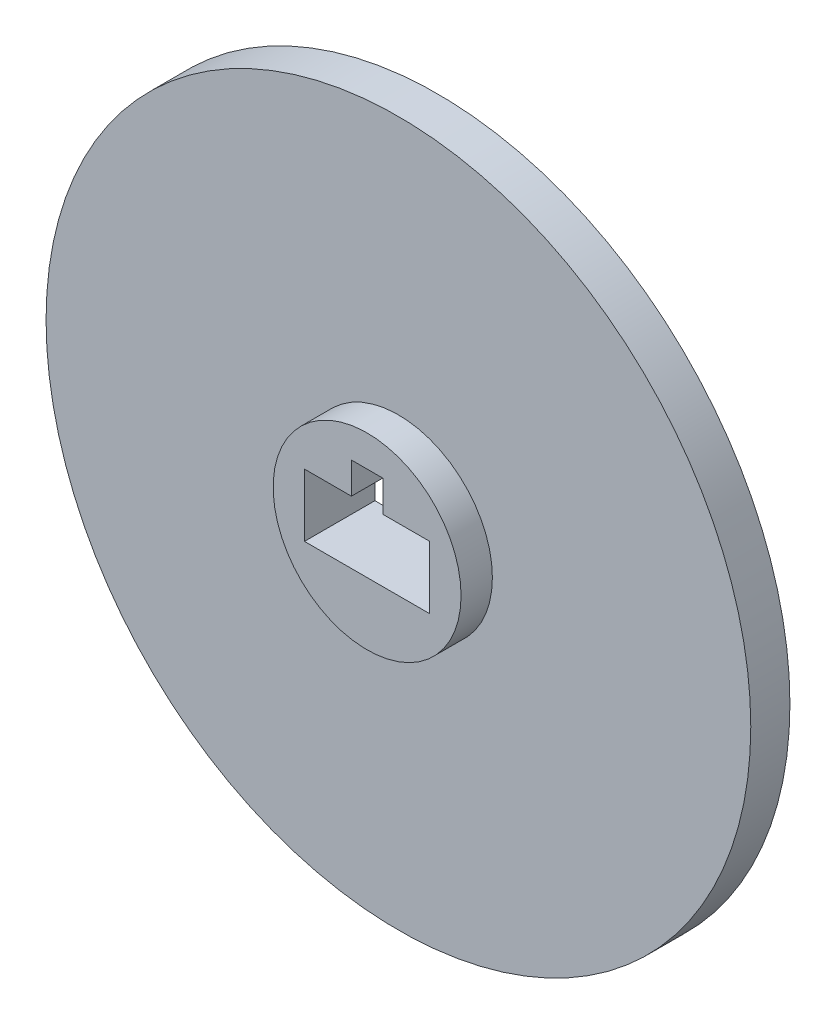
ISO-10303-21;
HEADER;
FILE_DESCRIPTION(('STEP AP214'),'2;1');
FILE_NAME('part.step','',(''),(''),'','','');
FILE_SCHEMA(('AUTOMOTIVE_DESIGN { 1 0 10303 214 1 1 1 1 }'));
ENDSEC;
DATA;
#1=APPLICATION_CONTEXT('core data for automotive mechanical design processes');
#2=APPLICATION_PROTOCOL_DEFINITION('international standard','automotive_design',2000,#1);
#3=PRODUCT_CONTEXT('',#1,'mechanical');
#4=PRODUCT('Part','Part','',(#3));
#5=PRODUCT_RELATED_PRODUCT_CATEGORY('part','',(#4));
#6=PRODUCT_DEFINITION_FORMATION('','',#4);
#7=PRODUCT_DEFINITION_CONTEXT('part definition',#1,'design');
#8=PRODUCT_DEFINITION('design','',#6,#7);
#9=PRODUCT_DEFINITION_SHAPE('','',#8);
#10=(LENGTH_UNIT() NAMED_UNIT(*) SI_UNIT(.MILLI.,.METRE.));
#11=(NAMED_UNIT(*) PLANE_ANGLE_UNIT() SI_UNIT($,.RADIAN.));
#12=(NAMED_UNIT(*) SI_UNIT($,.STERADIAN.) SOLID_ANGLE_UNIT());
#13=UNCERTAINTY_MEASURE_WITH_UNIT(LENGTH_MEASURE(1.E-05),#10,'distance_accuracy_value','');
#14=(GEOMETRIC_REPRESENTATION_CONTEXT(3) GLOBAL_UNCERTAINTY_ASSIGNED_CONTEXT((#13)) GLOBAL_UNIT_ASSIGNED_CONTEXT((#10,
#11,#12)) REPRESENTATION_CONTEXT('',''));
#15=CARTESIAN_POINT('',(0.,0.,0.));
#16=DIRECTION('',(0.,0.,1.));
#17=DIRECTION('',(1.,0.,0.));
#18=AXIS2_PLACEMENT_3D('',#15,#16,#17);
#19=CARTESIAN_POINT('',(0.,0.,2.5));
#20=DIRECTION('',(0.,0.,-1.));
#21=DIRECTION('',(-1.,0.,0.));
#22=AXIS2_PLACEMENT_3D('',#19,#20,#21);
#23=CYLINDRICAL_SURFACE('',#22,22.5);
#24=CARTESIAN_POINT('',(0.,0.,2.5));
#25=DIRECTION('',(0.,0.,1.));
#26=DIRECTION('',(1.,0.,0.));
#27=AXIS2_PLACEMENT_3D('',#24,#25,#26);
#28=CIRCLE('',#27,22.5);
#29=CARTESIAN_POINT('',(22.5,0.,2.5));
#30=VERTEX_POINT('',#29);
#31=EDGE_CURVE('E41',#30,#30,#28,.T.);
#32=ORIENTED_EDGE('',*,*,#31,.F.);
#33=EDGE_LOOP('',(#32));
#34=FACE_BOUND('',#33,.T.);
#35=CARTESIAN_POINT('',(0.,0.,0.));
#36=DIRECTION('',(0.,0.,1.));
#37=DIRECTION('',(1.,0.,0.));
#38=AXIS2_PLACEMENT_3D('',#35,#36,#37);
#39=CIRCLE('',#38,22.5);
#40=CARTESIAN_POINT('',(22.5,0.,0.));
#41=VERTEX_POINT('',#40);
#42=EDGE_CURVE('E36',#41,#41,#39,.T.);
#43=ORIENTED_EDGE('',*,*,#42,.T.);
#44=EDGE_LOOP('',(#43));
#45=FACE_BOUND('',#44,.T.);
#46=ADVANCED_FACE('F33',(#34,#45),#23,.T.);
#47=CARTESIAN_POINT('',(0.,0.,2.5));
#48=DIRECTION('',(0.,0.,1.));
#49=DIRECTION('',(1.,0.,0.));
#50=AXIS2_PLACEMENT_3D('',#47,#48,#49);
#51=PLANE('',#50);
#52=CARTESIAN_POINT('',(0.,0.,2.5));
#53=DIRECTION('',(0.,0.,1.));
#54=DIRECTION('',(1.,0.,0.));
#55=AXIS2_PLACEMENT_3D('',#52,#53,#54);
#56=CIRCLE('',#55,6.);
#57=CARTESIAN_POINT('',(6.,0.,2.5));
#58=VERTEX_POINT('',#57);
#59=EDGE_CURVE('E11',#58,#58,#56,.T.);
#60=ORIENTED_EDGE('',*,*,#59,.F.);
#61=EDGE_LOOP('',(#60));
#62=FACE_BOUND('',#61,.T.);
#63=ORIENTED_EDGE('',*,*,#31,.T.);
#64=EDGE_LOOP('',(#63));
#65=FACE_BOUND('',#64,.T.);
#66=ADVANCED_FACE('F181',(#62,#65),#51,.T.);
#67=CARTESIAN_POINT('',(0.,0.,0.));
#68=DIRECTION('',(0.,0.,1.));
#69=DIRECTION('',(1.,0.,0.));
#70=AXIS2_PLACEMENT_3D('',#67,#68,#69);
#71=PLANE('',#70);
#72=DIRECTION('',(1.,0.,0.));
#73=VECTOR('',#72,1.);
#74=CARTESIAN_POINT('',(0.,-2.,0.));
#75=LINE('',#74,#73);
#76=CARTESIAN_POINT('',(-4.,-2.,0.));
#77=VERTEX_POINT('',#76);
#78=CARTESIAN_POINT('',(4.,-2.,0.));
#79=VERTEX_POINT('',#78);
#80=EDGE_CURVE('E163',#77,#79,#75,.T.);
#81=ORIENTED_EDGE('',*,*,#80,.T.);
#82=DIRECTION('',(0.,1.,0.));
#83=VECTOR('',#82,1.);
#84=CARTESIAN_POINT('',(4.,0.,0.));
#85=LINE('',#84,#83);
#86=CARTESIAN_POINT('',(4.,2.,0.));
#87=VERTEX_POINT('',#86);
#88=EDGE_CURVE('E166',#79,#87,#85,.T.);
#89=ORIENTED_EDGE('',*,*,#88,.T.);
#90=DIRECTION('',(-1.,0.,0.));
#91=VECTOR('',#90,1.);
#92=CARTESIAN_POINT('',(0.,2.,0.));
#93=LINE('',#92,#91);
#94=CARTESIAN_POINT('',(1.,2.,0.));
#95=VERTEX_POINT('',#94);
#96=EDGE_CURVE('E138',#87,#95,#93,.T.);
#97=ORIENTED_EDGE('',*,*,#96,.T.);
#98=DIRECTION('',(0.,1.,0.));
#99=VECTOR('',#98,1.);
#100=CARTESIAN_POINT('',(1.,0.,0.));
#101=LINE('',#100,#99);
#102=CARTESIAN_POINT('',(1.,4.,0.));
#103=VERTEX_POINT('',#102);
#104=EDGE_CURVE('E105',#95,#103,#101,.T.);
#105=ORIENTED_EDGE('',*,*,#104,.T.);
#106=DIRECTION('',(-1.,0.,0.));
#107=VECTOR('',#106,1.);
#108=CARTESIAN_POINT('',(0.,4.,0.));
#109=LINE('',#108,#107);
#110=CARTESIAN_POINT('',(-1.,4.,0.));
#111=VERTEX_POINT('',#110);
#112=EDGE_CURVE('E151',#103,#111,#109,.T.);
#113=ORIENTED_EDGE('',*,*,#112,.T.);
#114=DIRECTION('',(0.,-1.,0.));
#115=VECTOR('',#114,1.);
#116=CARTESIAN_POINT('',(-1.,0.,0.));
#117=LINE('',#116,#115);
#118=CARTESIAN_POINT('',(-1.,2.,0.));
#119=VERTEX_POINT('',#118);
#120=EDGE_CURVE('E154',#111,#119,#117,.T.);
#121=ORIENTED_EDGE('',*,*,#120,.T.);
#122=DIRECTION('',(-1.,0.,0.));
#123=VECTOR('',#122,1.);
#124=CARTESIAN_POINT('',(0.,2.,0.));
#125=LINE('',#124,#123);
#126=CARTESIAN_POINT('',(-4.,2.,0.));
#127=VERTEX_POINT('',#126);
#128=EDGE_CURVE('E157',#119,#127,#125,.T.);
#129=ORIENTED_EDGE('',*,*,#128,.T.);
#130=DIRECTION('',(0.,-1.,0.));
#131=VECTOR('',#130,1.);
#132=CARTESIAN_POINT('',(-4.,0.,0.));
#133=LINE('',#132,#131);
#134=EDGE_CURVE('E160',#127,#77,#133,.T.);
#135=ORIENTED_EDGE('',*,*,#134,.T.);
#136=EDGE_LOOP('',(#81,#89,#97,#105,#113,#121,#129,#135));
#137=FACE_BOUND('',#136,.T.);
#138=ORIENTED_EDGE('',*,*,#42,.F.);
#139=EDGE_LOOP('',(#138));
#140=FACE_BOUND('',#139,.T.);
#141=ADVANCED_FACE('F178',(#137,#140),#71,.F.);
#142=CARTESIAN_POINT('',(0.,0.,4.5));
#143=DIRECTION('',(0.,0.,-1.));
#144=DIRECTION('',(-1.,0.,0.));
#145=AXIS2_PLACEMENT_3D('',#142,#143,#144);
#146=CYLINDRICAL_SURFACE('',#145,6.);
#147=CARTESIAN_POINT('',(0.,0.,4.5));
#148=DIRECTION('',(0.,0.,1.));
#149=DIRECTION('',(1.,0.,0.));
#150=AXIS2_PLACEMENT_3D('',#147,#148,#149);
#151=CIRCLE('',#150,6.);
#152=CARTESIAN_POINT('',(6.,0.,4.5));
#153=VERTEX_POINT('',#152);
#154=EDGE_CURVE('E169',#153,#153,#151,.T.);
#155=ORIENTED_EDGE('',*,*,#154,.F.);
#156=EDGE_LOOP('',(#155));
#157=FACE_BOUND('',#156,.T.);
#158=ORIENTED_EDGE('',*,*,#59,.T.);
#159=EDGE_LOOP('',(#158));
#160=FACE_BOUND('',#159,.T.);
#161=ADVANCED_FACE('F180',(#157,#160),#146,.T.);
#162=CARTESIAN_POINT('',(0.,0.,4.5));
#163=DIRECTION('',(0.,0.,1.));
#164=DIRECTION('',(1.,0.,0.));
#165=AXIS2_PLACEMENT_3D('',#162,#163,#164);
#166=PLANE('',#165);
#167=DIRECTION('',(0.,1.,0.));
#168=VECTOR('',#167,1.);
#169=CARTESIAN_POINT('',(4.,2.,4.5));
#170=LINE('',#169,#168);
#171=CARTESIAN_POINT('',(4.,-2.,4.5));
#172=VERTEX_POINT('',#171);
#173=CARTESIAN_POINT('',(4.,2.,4.5));
#174=VERTEX_POINT('',#173);
#175=EDGE_CURVE('E57',#172,#174,#170,.T.);
#176=ORIENTED_EDGE('',*,*,#175,.F.);
#177=DIRECTION('',(1.,0.,0.));
#178=VECTOR('',#177,1.);
#179=CARTESIAN_POINT('',(-4.,-2.,4.5));
#180=LINE('',#179,#178);
#181=CARTESIAN_POINT('',(-4.,-2.,4.5));
#182=VERTEX_POINT('',#181);
#183=EDGE_CURVE('E133',#182,#172,#180,.T.);
#184=ORIENTED_EDGE('',*,*,#183,.F.);
#185=DIRECTION('',(0.,-1.,0.));
#186=VECTOR('',#185,1.);
#187=CARTESIAN_POINT('',(-4.,2.,4.5));
#188=LINE('',#187,#186);
#189=CARTESIAN_POINT('',(-4.,2.,4.5));
#190=VERTEX_POINT('',#189);
#191=EDGE_CURVE('E130',#190,#182,#188,.T.);
#192=ORIENTED_EDGE('',*,*,#191,.F.);
#193=DIRECTION('',(-1.,0.,0.));
#194=VECTOR('',#193,1.);
#195=CARTESIAN_POINT('',(-4.,2.,4.5));
#196=LINE('',#195,#194);
#197=CARTESIAN_POINT('',(-1.,2.,4.5));
#198=VERTEX_POINT('',#197);
#199=EDGE_CURVE('E127',#198,#190,#196,.T.);
#200=ORIENTED_EDGE('',*,*,#199,.F.);
#201=DIRECTION('',(0.,-1.,0.));
#202=VECTOR('',#201,1.);
#203=CARTESIAN_POINT('',(-1.,4.,4.5));
#204=LINE('',#203,#202);
#205=CARTESIAN_POINT('',(-1.,4.,4.5));
#206=VERTEX_POINT('',#205);
#207=EDGE_CURVE('E121',#206,#198,#204,.T.);
#208=ORIENTED_EDGE('',*,*,#207,.F.);
#209=DIRECTION('',(-1.,0.,0.));
#210=VECTOR('',#209,1.);
#211=CARTESIAN_POINT('',(1.,4.,4.5));
#212=LINE('',#211,#210);
#213=CARTESIAN_POINT('',(1.,4.,4.5));
#214=VERTEX_POINT('',#213);
#215=EDGE_CURVE('E119',#214,#206,#212,.T.);
#216=ORIENTED_EDGE('',*,*,#215,.F.);
#217=DIRECTION('',(0.,1.,0.));
#218=VECTOR('',#217,1.);
#219=CARTESIAN_POINT('',(1.,4.,4.5));
#220=LINE('',#219,#218);
#221=CARTESIAN_POINT('',(1.,2.,4.5));
#222=VERTEX_POINT('',#221);
#223=EDGE_CURVE('E102',#222,#214,#220,.T.);
#224=ORIENTED_EDGE('',*,*,#223,.F.);
#225=DIRECTION('',(-1.,0.,0.));
#226=VECTOR('',#225,1.);
#227=CARTESIAN_POINT('',(1.,2.,4.5));
#228=LINE('',#227,#226);
#229=EDGE_CURVE('E111',#174,#222,#228,.T.);
#230=ORIENTED_EDGE('',*,*,#229,.F.);
#231=EDGE_LOOP('',(#176,#184,#192,#200,#208,#216,#224,#230));
#232=FACE_BOUND('',#231,.T.);
#233=ORIENTED_EDGE('',*,*,#154,.T.);
#234=EDGE_LOOP('',(#233));
#235=FACE_BOUND('',#234,.T.);
#236=ADVANCED_FACE('F115',(#232,#235),#166,.T.);
#237=CARTESIAN_POINT('',(4.,2.,-5.5));
#238=DIRECTION('',(1.,0.,0.));
#239=DIRECTION('',(0.,1.,0.));
#240=AXIS2_PLACEMENT_3D('',#237,#238,#239);
#241=PLANE('',#240);
#242=DIRECTION('',(0.,0.,1.));
#243=VECTOR('',#242,1.);
#244=CARTESIAN_POINT('',(4.,-2.,-5.5));
#245=LINE('',#244,#243);
#246=EDGE_CURVE('E136',#79,#172,#245,.T.);
#247=ORIENTED_EDGE('',*,*,#246,.T.);
#248=ORIENTED_EDGE('',*,*,#175,.T.);
#249=DIRECTION('',(0.,0.,1.));
#250=VECTOR('',#249,1.);
#251=CARTESIAN_POINT('',(4.,2.,-5.5));
#252=LINE('',#251,#250);
#253=EDGE_CURVE('E108',#87,#174,#252,.T.);
#254=ORIENTED_EDGE('',*,*,#253,.F.);
#255=ORIENTED_EDGE('',*,*,#88,.F.);
#256=EDGE_LOOP('',(#247,#248,#254,#255));
#257=FACE_BOUND('',#256,.T.);
#258=ADVANCED_FACE('F218',(#257),#241,.F.);
#259=CARTESIAN_POINT('',(-4.,-2.,-5.5));
#260=DIRECTION('',(0.,-1.,0.));
#261=DIRECTION('',(0.,0.,-1.));
#262=AXIS2_PLACEMENT_3D('',#259,#260,#261);
#263=PLANE('',#262);
#264=DIRECTION('',(0.,0.,1.));
#265=VECTOR('',#264,1.);
#266=CARTESIAN_POINT('',(-4.,-2.,-5.5));
#267=LINE('',#266,#265);
#268=EDGE_CURVE('E139',#77,#182,#267,.T.);
#269=ORIENTED_EDGE('',*,*,#268,.T.);
#270=ORIENTED_EDGE('',*,*,#183,.T.);
#271=ORIENTED_EDGE('',*,*,#246,.F.);
#272=ORIENTED_EDGE('',*,*,#80,.F.);
#273=EDGE_LOOP('',(#269,#270,#271,#272));
#274=FACE_BOUND('',#273,.T.);
#275=ADVANCED_FACE('F227',(#274),#263,.F.);
#276=CARTESIAN_POINT('',(-4.,2.,-5.5));
#277=DIRECTION('',(-1.,0.,0.));
#278=DIRECTION('',(0.,0.,1.));
#279=AXIS2_PLACEMENT_3D('',#276,#277,#278);
#280=PLANE('',#279);
#281=DIRECTION('',(0.,0.,1.));
#282=VECTOR('',#281,1.);
#283=CARTESIAN_POINT('',(-4.,2.,-5.5));
#284=LINE('',#283,#282);
#285=EDGE_CURVE('E141',#127,#190,#284,.T.);
#286=ORIENTED_EDGE('',*,*,#285,.T.);
#287=ORIENTED_EDGE('',*,*,#191,.T.);
#288=ORIENTED_EDGE('',*,*,#268,.F.);
#289=ORIENTED_EDGE('',*,*,#134,.F.);
#290=EDGE_LOOP('',(#286,#287,#288,#289));
#291=FACE_BOUND('',#290,.T.);
#292=ADVANCED_FACE('F236',(#291),#280,.F.);
#293=CARTESIAN_POINT('',(-4.,2.,-5.5));
#294=DIRECTION('',(0.,1.,0.));
#295=DIRECTION('',(-1.,0.,0.));
#296=AXIS2_PLACEMENT_3D('',#293,#294,#295);
#297=PLANE('',#296);
#298=DIRECTION('',(0.,0.,1.));
#299=VECTOR('',#298,1.);
#300=CARTESIAN_POINT('',(-1.,2.,-5.5));
#301=LINE('',#300,#299);
#302=EDGE_CURVE('E143',#119,#198,#301,.T.);
#303=ORIENTED_EDGE('',*,*,#302,.T.);
#304=ORIENTED_EDGE('',*,*,#199,.T.);
#305=ORIENTED_EDGE('',*,*,#285,.F.);
#306=ORIENTED_EDGE('',*,*,#128,.F.);
#307=EDGE_LOOP('',(#303,#304,#305,#306));
#308=FACE_BOUND('',#307,.T.);
#309=ADVANCED_FACE('F246',(#308),#297,.F.);
#310=CARTESIAN_POINT('',(-1.,4.,-5.5));
#311=DIRECTION('',(-1.,0.,0.));
#312=DIRECTION('',(0.,-1.,0.));
#313=AXIS2_PLACEMENT_3D('',#310,#311,#312);
#314=PLANE('',#313);
#315=DIRECTION('',(0.,0.,1.));
#316=VECTOR('',#315,1.);
#317=CARTESIAN_POINT('',(-1.,4.,-5.5));
#318=LINE('',#317,#316);
#319=EDGE_CURVE('E145',#111,#206,#318,.T.);
#320=ORIENTED_EDGE('',*,*,#319,.T.);
#321=ORIENTED_EDGE('',*,*,#207,.T.);
#322=ORIENTED_EDGE('',*,*,#302,.F.);
#323=ORIENTED_EDGE('',*,*,#120,.F.);
#324=EDGE_LOOP('',(#320,#321,#322,#323));
#325=FACE_BOUND('',#324,.T.);
#326=ADVANCED_FACE('F256',(#325),#314,.F.);
#327=CARTESIAN_POINT('',(1.,4.,-5.5));
#328=DIRECTION('',(0.,1.,0.));
#329=DIRECTION('',(0.,0.,1.));
#330=AXIS2_PLACEMENT_3D('',#327,#328,#329);
#331=PLANE('',#330);
#332=DIRECTION('',(0.,0.,1.));
#333=VECTOR('',#332,1.);
#334=CARTESIAN_POINT('',(1.,4.,-5.5));
#335=LINE('',#334,#333);
#336=EDGE_CURVE('E107',#103,#214,#335,.T.);
#337=ORIENTED_EDGE('',*,*,#336,.T.);
#338=ORIENTED_EDGE('',*,*,#215,.T.);
#339=ORIENTED_EDGE('',*,*,#319,.F.);
#340=ORIENTED_EDGE('',*,*,#112,.F.);
#341=EDGE_LOOP('',(#337,#338,#339,#340));
#342=FACE_BOUND('',#341,.T.);
#343=ADVANCED_FACE('F266',(#342),#331,.F.);
#344=CARTESIAN_POINT('',(1.,4.,-5.5));
#345=DIRECTION('',(1.,0.,0.));
#346=DIRECTION('',(0.,1.,0.));
#347=AXIS2_PLACEMENT_3D('',#344,#345,#346);
#348=PLANE('',#347);
#349=DIRECTION('',(0.,0.,1.));
#350=VECTOR('',#349,1.);
#351=CARTESIAN_POINT('',(1.,2.,-5.5));
#352=LINE('',#351,#350);
#353=EDGE_CURVE('E49',#95,#222,#352,.T.);
#354=ORIENTED_EDGE('',*,*,#353,.T.);
#355=ORIENTED_EDGE('',*,*,#223,.T.);
#356=ORIENTED_EDGE('',*,*,#336,.F.);
#357=ORIENTED_EDGE('',*,*,#104,.F.);
#358=EDGE_LOOP('',(#354,#355,#356,#357));
#359=FACE_BOUND('',#358,.T.);
#360=ADVANCED_FACE('F99',(#359),#348,.F.);
#361=CARTESIAN_POINT('',(1.,2.,-5.5));
#362=DIRECTION('',(0.,1.,0.));
#363=DIRECTION('',(0.,0.,1.));
#364=AXIS2_PLACEMENT_3D('',#361,#362,#363);
#365=PLANE('',#364);
#366=ORIENTED_EDGE('',*,*,#253,.T.);
#367=ORIENTED_EDGE('',*,*,#229,.T.);
#368=ORIENTED_EDGE('',*,*,#353,.F.);
#369=ORIENTED_EDGE('',*,*,#96,.F.);
#370=EDGE_LOOP('',(#366,#367,#368,#369));
#371=FACE_BOUND('',#370,.T.);
#372=ADVANCED_FACE('F112',(#371),#365,.F.);
#373=CLOSED_SHELL('',(#46,#66,#141,#161,#236,#258,#275,#292,#309,#326,#343,#360,#372));
#374=MANIFOLD_SOLID_BREP('B2',#373);
#375=ADVANCED_BREP_SHAPE_REPRESENTATION('',(#18,#374),#14);
#376=SHAPE_DEFINITION_REPRESENTATION(#9,#375);
ENDSEC;
END-ISO-10303-21;
